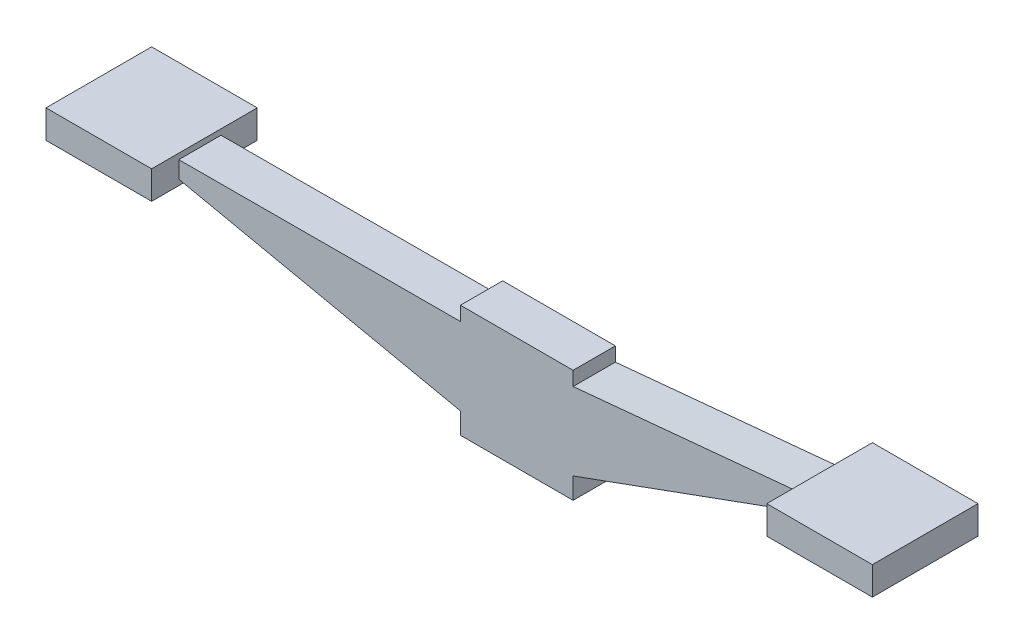
ISO-10303-21;
HEADER;
FILE_DESCRIPTION(('STEP AP214'),'2;1');
FILE_NAME('part.step','',(''),(''),'','','');
FILE_SCHEMA(('AUTOMOTIVE_DESIGN { 1 0 10303 214 1 1 1 1 }'));
ENDSEC;
DATA;
#1=APPLICATION_CONTEXT('core data for automotive mechanical design processes');
#2=APPLICATION_PROTOCOL_DEFINITION('international standard','automotive_design',2000,#1);
#3=PRODUCT_CONTEXT('',#1,'mechanical');
#4=PRODUCT('Part','Part','',(#3));
#5=PRODUCT_RELATED_PRODUCT_CATEGORY('part','',(#4));
#6=PRODUCT_DEFINITION_FORMATION('','',#4);
#7=PRODUCT_DEFINITION_CONTEXT('part definition',#1,'design');
#8=PRODUCT_DEFINITION('design','',#6,#7);
#9=PRODUCT_DEFINITION_SHAPE('','',#8);
#10=(LENGTH_UNIT() NAMED_UNIT(*) SI_UNIT(.MILLI.,.METRE.));
#11=(NAMED_UNIT(*) PLANE_ANGLE_UNIT() SI_UNIT($,.RADIAN.));
#12=(NAMED_UNIT(*) SI_UNIT($,.STERADIAN.) SOLID_ANGLE_UNIT());
#13=UNCERTAINTY_MEASURE_WITH_UNIT(LENGTH_MEASURE(1.E-05),#10,'distance_accuracy_value','');
#14=(GEOMETRIC_REPRESENTATION_CONTEXT(3) GLOBAL_UNCERTAINTY_ASSIGNED_CONTEXT((#13)) GLOBAL_UNIT_ASSIGNED_CONTEXT((#10,
#11,#12)) REPRESENTATION_CONTEXT('',''));
#15=CARTESIAN_POINT('',(0.,0.,0.));
#16=DIRECTION('',(0.,0.,1.));
#17=DIRECTION('',(1.,0.,0.));
#18=AXIS2_PLACEMENT_3D('',#15,#16,#17);
#19=CARTESIAN_POINT('',(0.,40.,15.));
#20=DIRECTION('',(0.,1.,0.));
#21=DIRECTION('',(0.,0.,1.));
#22=AXIS2_PLACEMENT_3D('',#19,#20,#21);
#23=PLANE('',#22);
#24=DIRECTION('',(1.,0.,0.));
#25=VECTOR('',#24,1.);
#26=CARTESIAN_POINT('',(0.,40.,-15.));
#27=LINE('',#26,#25);
#28=CARTESIAN_POINT('',(-40.,40.,-15.));
#29=VERTEX_POINT('',#28);
#30=CARTESIAN_POINT('',(40.,40.,-15.));
#31=VERTEX_POINT('',#30);
#32=EDGE_CURVE('E273',#29,#31,#27,.T.);
#33=ORIENTED_EDGE('',*,*,#32,.F.);
#34=DIRECTION('',(0.,0.,-1.));
#35=VECTOR('',#34,1.);
#36=CARTESIAN_POINT('',(-40.,40.,15.));
#37=LINE('',#36,#35);
#38=CARTESIAN_POINT('',(-40.,40.,15.));
#39=VERTEX_POINT('',#38);
#40=EDGE_CURVE('E188',#39,#29,#37,.T.);
#41=ORIENTED_EDGE('',*,*,#40,.F.);
#42=DIRECTION('',(1.,0.,0.));
#43=VECTOR('',#42,1.);
#44=CARTESIAN_POINT('',(0.,40.,15.));
#45=LINE('',#44,#43);
#46=CARTESIAN_POINT('',(40.,40.,15.));
#47=VERTEX_POINT('',#46);
#48=EDGE_CURVE('E231',#39,#47,#45,.T.);
#49=ORIENTED_EDGE('',*,*,#48,.T.);
#50=DIRECTION('',(0.,0.,-1.));
#51=VECTOR('',#50,1.);
#52=CARTESIAN_POINT('',(40.,40.,15.));
#53=LINE('',#52,#51);
#54=EDGE_CURVE('E238',#47,#31,#53,.T.);
#55=ORIENTED_EDGE('',*,*,#54,.T.);
#56=EDGE_LOOP('',(#33,#41,#49,#55));
#57=FACE_BOUND('',#56,.T.);
#58=ADVANCED_FACE('F136',(#57),#23,.T.);
#59=CARTESIAN_POINT('',(0.,-40.,15.));
#60=DIRECTION('',(0.,1.,0.));
#61=DIRECTION('',(0.,0.,1.));
#62=AXIS2_PLACEMENT_3D('',#59,#60,#61);
#63=PLANE('',#62);
#64=DIRECTION('',(1.,0.,0.));
#65=VECTOR('',#64,1.);
#66=CARTESIAN_POINT('',(0.,-40.,-15.));
#67=LINE('',#66,#65);
#68=CARTESIAN_POINT('',(-40.,-40.,-15.));
#69=VERTEX_POINT('',#68);
#70=CARTESIAN_POINT('',(40.,-40.,-15.));
#71=VERTEX_POINT('',#70);
#72=EDGE_CURVE('E262',#69,#71,#67,.T.);
#73=ORIENTED_EDGE('',*,*,#72,.T.);
#74=DIRECTION('',(0.,0.,-1.));
#75=VECTOR('',#74,1.);
#76=CARTESIAN_POINT('',(40.,-40.,15.));
#77=LINE('',#76,#75);
#78=CARTESIAN_POINT('',(40.,-40.,15.));
#79=VERTEX_POINT('',#78);
#80=EDGE_CURVE('E286',#79,#71,#77,.T.);
#81=ORIENTED_EDGE('',*,*,#80,.F.);
#82=DIRECTION('',(1.,0.,0.));
#83=VECTOR('',#82,1.);
#84=CARTESIAN_POINT('',(0.,-40.,15.));
#85=LINE('',#84,#83);
#86=CARTESIAN_POINT('',(-40.,-40.,15.));
#87=VERTEX_POINT('',#86);
#88=EDGE_CURVE('E326',#87,#79,#85,.T.);
#89=ORIENTED_EDGE('',*,*,#88,.F.);
#90=DIRECTION('',(0.,0.,-1.));
#91=VECTOR('',#90,1.);
#92=CARTESIAN_POINT('',(-40.,-40.,15.));
#93=LINE('',#92,#91);
#94=EDGE_CURVE('E289',#87,#69,#93,.T.);
#95=ORIENTED_EDGE('',*,*,#94,.T.);
#96=EDGE_LOOP('',(#73,#81,#89,#95));
#97=FACE_BOUND('',#96,.T.);
#98=ADVANCED_FACE('F349',(#97),#63,.F.);
#99=CARTESIAN_POINT('',(-40.,0.,15.));
#100=DIRECTION('',(-1.,0.,0.));
#101=DIRECTION('',(0.,0.,1.));
#102=AXIS2_PLACEMENT_3D('',#99,#100,#101);
#103=PLANE('',#102);
#104=DIRECTION('',(0.,1.,0.));
#105=VECTOR('',#104,1.);
#106=CARTESIAN_POINT('',(-40.,0.,-15.));
#107=LINE('',#106,#105);
#108=CARTESIAN_POINT('',(-40.,-25.,-15.));
#109=VERTEX_POINT('',#108);
#110=EDGE_CURVE('E259',#69,#109,#107,.T.);
#111=ORIENTED_EDGE('',*,*,#110,.F.);
#112=ORIENTED_EDGE('',*,*,#94,.F.);
#113=DIRECTION('',(0.,1.,0.));
#114=VECTOR('',#113,1.);
#115=CARTESIAN_POINT('',(-40.,0.,15.));
#116=LINE('',#115,#114);
#117=CARTESIAN_POINT('',(-40.,-25.,15.));
#118=VERTEX_POINT('',#117);
#119=EDGE_CURVE('E249',#87,#118,#116,.T.);
#120=ORIENTED_EDGE('',*,*,#119,.T.);
#121=DIRECTION('',(0.,0.,-1.));
#122=VECTOR('',#121,1.);
#123=CARTESIAN_POINT('',(-40.,-25.,15.));
#124=LINE('',#123,#122);
#125=EDGE_CURVE('E200',#118,#109,#124,.T.);
#126=ORIENTED_EDGE('',*,*,#125,.T.);
#127=EDGE_LOOP('',(#111,#112,#120,#126));
#128=FACE_BOUND('',#127,.T.);
#129=ADVANCED_FACE('F341',(#128),#103,.T.);
#130=CARTESIAN_POINT('',(-40.,30.,-15.));
#131=VERTEX_POINT('',#130);
#132=EDGE_CURVE('E263',#131,#29,#107,.T.);
#133=ORIENTED_EDGE('',*,*,#132,.F.);
#134=DIRECTION('',(0.,0.,-1.));
#135=VECTOR('',#134,1.);
#136=CARTESIAN_POINT('',(-40.,30.,15.));
#137=LINE('',#136,#135);
#138=CARTESIAN_POINT('',(-40.,30.,15.));
#139=VERTEX_POINT('',#138);
#140=EDGE_CURVE('E155',#139,#131,#137,.T.);
#141=ORIENTED_EDGE('',*,*,#140,.F.);
#142=EDGE_CURVE('E246',#139,#39,#116,.T.);
#143=ORIENTED_EDGE('',*,*,#142,.T.);
#144=ORIENTED_EDGE('',*,*,#40,.T.);
#145=EDGE_LOOP('',(#133,#141,#143,#144));
#146=FACE_BOUND('',#145,.T.);
#147=ADVANCED_FACE('F339',(#146),#103,.T.);
#148=CARTESIAN_POINT('',(40.,0.,15.));
#149=DIRECTION('',(-1.,0.,0.));
#150=DIRECTION('',(0.,0.,1.));
#151=AXIS2_PLACEMENT_3D('',#148,#149,#150);
#152=PLANE('',#151);
#153=DIRECTION('',(0.,1.,0.));
#154=VECTOR('',#153,1.);
#155=CARTESIAN_POINT('',(40.,0.,-15.));
#156=LINE('',#155,#154);
#157=CARTESIAN_POINT('',(40.,30.,-15.));
#158=VERTEX_POINT('',#157);
#159=EDGE_CURVE('E241',#158,#31,#156,.T.);
#160=ORIENTED_EDGE('',*,*,#159,.T.);
#161=ORIENTED_EDGE('',*,*,#54,.F.);
#162=DIRECTION('',(0.,1.,0.));
#163=VECTOR('',#162,1.);
#164=CARTESIAN_POINT('',(40.,0.,15.));
#165=LINE('',#164,#163);
#166=CARTESIAN_POINT('',(40.,30.,15.));
#167=VERTEX_POINT('',#166);
#168=EDGE_CURVE('E226',#167,#47,#165,.T.);
#169=ORIENTED_EDGE('',*,*,#168,.F.);
#170=DIRECTION('',(0.,0.,-1.));
#171=VECTOR('',#170,1.);
#172=CARTESIAN_POINT('',(40.,30.,15.));
#173=LINE('',#172,#171);
#174=EDGE_CURVE('E244',#167,#158,#173,.T.);
#175=ORIENTED_EDGE('',*,*,#174,.T.);
#176=EDGE_LOOP('',(#160,#161,#169,#175));
#177=FACE_BOUND('',#176,.T.);
#178=ADVANCED_FACE('F239',(#177),#152,.F.);
#179=CARTESIAN_POINT('',(40.,-25.,-15.));
#180=VERTEX_POINT('',#179);
#181=EDGE_CURVE('E265',#71,#180,#156,.T.);
#182=ORIENTED_EDGE('',*,*,#181,.T.);
#183=DIRECTION('',(0.,0.,-1.));
#184=VECTOR('',#183,1.);
#185=CARTESIAN_POINT('',(40.,-25.,15.));
#186=LINE('',#185,#184);
#187=CARTESIAN_POINT('',(40.,-25.,15.));
#188=VERTEX_POINT('',#187);
#189=EDGE_CURVE('E283',#188,#180,#186,.T.);
#190=ORIENTED_EDGE('',*,*,#189,.F.);
#191=EDGE_CURVE('E236',#79,#188,#165,.T.);
#192=ORIENTED_EDGE('',*,*,#191,.F.);
#193=ORIENTED_EDGE('',*,*,#80,.T.);
#194=EDGE_LOOP('',(#182,#190,#192,#193));
#195=FACE_BOUND('',#194,.T.);
#196=ADVANCED_FACE('F347',(#195),#152,.F.);
#197=CARTESIAN_POINT('',(0.,0.,15.));
#198=DIRECTION('',(0.,0.,1.));
#199=DIRECTION('',(1.,0.,0.));
#200=AXIS2_PLACEMENT_3D('',#197,#198,#199);
#201=PLANE('',#200);
#202=DIRECTION('',(0.,-1.,0.));
#203=VECTOR('',#202,1.);
#204=CARTESIAN_POINT('',(200.,1.46081976924363E-13,15.));
#205=LINE('',#204,#203);
#206=CARTESIAN_POINT('',(200.,45.2352374825919,15.));
#207=VERTEX_POINT('',#206);
#208=CARTESIAN_POINT('',(200.,33.2352374825919,15.));
#209=VERTEX_POINT('',#208);
#210=EDGE_CURVE('E425',#207,#209,#205,.T.);
#211=ORIENTED_EDGE('',*,*,#210,.F.);
#212=DIRECTION('',(0.995497150601956,0.0947914718916521,0.));
#213=VECTOR('',#212,1.);
#214=CARTESIAN_POINT('',(-2.47152227934972,25.9558516989182,15.));
#215=LINE('',#214,#213);
#216=EDGE_CURVE('E233',#167,#207,#215,.T.);
#217=ORIENTED_EDGE('',*,*,#216,.F.);
#218=ORIENTED_EDGE('',*,*,#168,.T.);
#219=ORIENTED_EDGE('',*,*,#48,.F.);
#220=ORIENTED_EDGE('',*,*,#142,.F.);
#221=DIRECTION('',(-0.999997014817931,-0.00244343103587318,0.));
#222=VECTOR('',#221,1.);
#223=CARTESIAN_POINT('',(-0.0735415264626827,30.0975578390147,15.));
#224=LINE('',#223,#222);
#225=CARTESIAN_POINT('',(-240.,29.5113123340037,15.));
#226=VERTEX_POINT('',#225);
#227=EDGE_CURVE('E320',#139,#226,#224,.T.);
#228=ORIENTED_EDGE('',*,*,#227,.T.);
#229=DIRECTION('',(0.,1.,0.));
#230=VECTOR('',#229,1.);
#231=CARTESIAN_POINT('',(-240.,0.,15.));
#232=LINE('',#231,#230);
#233=CARTESIAN_POINT('',(-240.,17.5113123340037,15.));
#234=VERTEX_POINT('',#233);
#235=EDGE_CURVE('E300',#234,#226,#232,.T.);
#236=ORIENTED_EDGE('',*,*,#235,.F.);
#237=DIRECTION('',(-0.978147600733806,0.207911690817756,0.));
#238=VECTOR('',#237,1.);
#239=CARTESIAN_POINT('',(-6.81329888559535,-32.0540510820484,15.));
#240=LINE('',#239,#238);
#241=EDGE_CURVE('E323',#118,#234,#240,.T.);
#242=ORIENTED_EDGE('',*,*,#241,.F.);
#243=ORIENTED_EDGE('',*,*,#119,.F.);
#244=ORIENTED_EDGE('',*,*,#88,.T.);
#245=ORIENTED_EDGE('',*,*,#191,.T.);
#246=DIRECTION('',(0.939692620785909,0.342020143325666,0.));
#247=VECTOR('',#246,1.);
#248=CARTESIAN_POINT('',(12.7139562587021,-34.931307732718,15.));
#249=LINE('',#248,#247);
#250=EDGE_CURVE('E327',#188,#209,#249,.T.);
#251=ORIENTED_EDGE('',*,*,#250,.T.);
#252=EDGE_LOOP('',(#211,#217,#218,#219,#220,#228,#236,#242,#243,#244,#245,#251));
#253=FACE_BOUND('',#252,.T.);
#254=ADVANCED_FACE('F228',(#253),#201,.T.);
#255=CARTESIAN_POINT('',(0.,0.,-15.));
#256=DIRECTION('',(0.,0.,1.));
#257=DIRECTION('',(1.,0.,0.));
#258=AXIS2_PLACEMENT_3D('',#255,#256,#257);
#259=PLANE('',#258);
#260=DIRECTION('',(0.995497150601956,0.0947914718916521,0.));
#261=VECTOR('',#260,1.);
#262=CARTESIAN_POINT('',(-2.47152227934972,25.9558516989182,-15.));
#263=LINE('',#262,#261);
#264=CARTESIAN_POINT('',(200.,45.2352374825919,-15.));
#265=VERTEX_POINT('',#264);
#266=EDGE_CURVE('E270',#158,#265,#263,.T.);
#267=ORIENTED_EDGE('',*,*,#266,.T.);
#268=DIRECTION('',(0.,-1.,0.));
#269=VECTOR('',#268,1.);
#270=CARTESIAN_POINT('',(200.,1.46081976924363E-13,-15.));
#271=LINE('',#270,#269);
#272=CARTESIAN_POINT('',(200.,33.2352374825919,-15.));
#273=VERTEX_POINT('',#272);
#274=EDGE_CURVE('E424',#265,#273,#271,.T.);
#275=ORIENTED_EDGE('',*,*,#274,.T.);
#276=DIRECTION('',(0.939692620785909,0.342020143325666,0.));
#277=VECTOR('',#276,1.);
#278=CARTESIAN_POINT('',(12.7139562587021,-34.931307732718,-15.));
#279=LINE('',#278,#277);
#280=EDGE_CURVE('E267',#180,#273,#279,.T.);
#281=ORIENTED_EDGE('',*,*,#280,.F.);
#282=ORIENTED_EDGE('',*,*,#181,.F.);
#283=ORIENTED_EDGE('',*,*,#72,.F.);
#284=ORIENTED_EDGE('',*,*,#110,.T.);
#285=DIRECTION('',(-0.978147600733806,0.207911690817756,0.));
#286=VECTOR('',#285,1.);
#287=CARTESIAN_POINT('',(-6.81329888559535,-32.0540510820484,-15.));
#288=LINE('',#287,#286);
#289=CARTESIAN_POINT('',(-240.,17.5113123340037,-15.));
#290=VERTEX_POINT('',#289);
#291=EDGE_CURVE('E255',#109,#290,#288,.T.);
#292=ORIENTED_EDGE('',*,*,#291,.T.);
#293=DIRECTION('',(0.,1.,0.));
#294=VECTOR('',#293,1.);
#295=CARTESIAN_POINT('',(-240.,0.,-15.));
#296=LINE('',#295,#294);
#297=CARTESIAN_POINT('',(-240.,29.5113123340037,-15.));
#298=VERTEX_POINT('',#297);
#299=EDGE_CURVE('E309',#290,#298,#296,.T.);
#300=ORIENTED_EDGE('',*,*,#299,.T.);
#301=DIRECTION('',(-0.999997014817931,-0.00244343103587318,0.));
#302=VECTOR('',#301,1.);
#303=CARTESIAN_POINT('',(-0.0735415264626827,30.0975578390147,-15.));
#304=LINE('',#303,#302);
#305=EDGE_CURVE('E253',#131,#298,#304,.T.);
#306=ORIENTED_EDGE('',*,*,#305,.F.);
#307=ORIENTED_EDGE('',*,*,#132,.T.);
#308=ORIENTED_EDGE('',*,*,#32,.T.);
#309=ORIENTED_EDGE('',*,*,#159,.F.);
#310=EDGE_LOOP('',(#267,#275,#281,#282,#283,#284,#292,#300,#306,#307,#308,#309));
#311=FACE_BOUND('',#310,.T.);
#312=ADVANCED_FACE('F336',(#311),#259,.F.);
#313=CARTESIAN_POINT('',(12.7139562587021,-34.931307732718,15.));
#314=DIRECTION('',(-0.342020143325666,0.939692620785909,0.));
#315=DIRECTION('',(-0.93969262078591,-0.342020143325666,0.));
#316=AXIS2_PLACEMENT_3D('',#313,#314,#315);
#317=PLANE('',#316);
#318=ORIENTED_EDGE('',*,*,#280,.T.);
#319=DIRECTION('',(0.,0.,-1.));
#320=VECTOR('',#319,1.);
#321=CARTESIAN_POINT('',(200.,33.2352374825919,15.));
#322=LINE('',#321,#320);
#323=EDGE_CURVE('E280',#209,#273,#322,.T.);
#324=ORIENTED_EDGE('',*,*,#323,.F.);
#325=ORIENTED_EDGE('',*,*,#250,.F.);
#326=ORIENTED_EDGE('',*,*,#189,.T.);
#327=EDGE_LOOP('',(#318,#324,#325,#326));
#328=FACE_BOUND('',#327,.T.);
#329=ADVANCED_FACE('F387',(#328),#317,.F.);
#330=CARTESIAN_POINT('',(-2.47152227934972,25.9558516989182,15.));
#331=DIRECTION('',(-0.094791471891652,0.995497150601956,0.));
#332=DIRECTION('',(-0.995497150601956,-0.094791471891652,0.));
#333=AXIS2_PLACEMENT_3D('',#330,#331,#332);
#334=PLANE('',#333);
#335=ORIENTED_EDGE('',*,*,#266,.F.);
#336=ORIENTED_EDGE('',*,*,#174,.F.);
#337=ORIENTED_EDGE('',*,*,#216,.T.);
#338=DIRECTION('',(0.,0.,-1.));
#339=VECTOR('',#338,1.);
#340=CARTESIAN_POINT('',(200.,45.2352374825919,15.));
#341=LINE('',#340,#339);
#342=EDGE_CURVE('E278',#207,#265,#341,.T.);
#343=ORIENTED_EDGE('',*,*,#342,.T.);
#344=EDGE_LOOP('',(#335,#336,#337,#343));
#345=FACE_BOUND('',#344,.T.);
#346=ADVANCED_FACE('F333',(#345),#334,.T.);
#347=CARTESIAN_POINT('',(-0.0735415264626827,30.0975578390147,15.));
#348=DIRECTION('',(0.00244343103587318,-0.999997014817931,0.));
#349=DIRECTION('',(0.999997014817931,0.00244343103587318,0.));
#350=AXIS2_PLACEMENT_3D('',#347,#348,#349);
#351=PLANE('',#350);
#352=ORIENTED_EDGE('',*,*,#305,.T.);
#353=DIRECTION('',(0.,0.,-1.));
#354=VECTOR('',#353,1.);
#355=CARTESIAN_POINT('',(-240.,29.5113123340037,15.));
#356=LINE('',#355,#354);
#357=EDGE_CURVE('E12',#226,#298,#356,.T.);
#358=ORIENTED_EDGE('',*,*,#357,.F.);
#359=ORIENTED_EDGE('',*,*,#227,.F.);
#360=ORIENTED_EDGE('',*,*,#140,.T.);
#361=EDGE_LOOP('',(#352,#358,#359,#360));
#362=FACE_BOUND('',#361,.T.);
#363=ADVANCED_FACE('F375',(#362),#351,.F.);
#364=CARTESIAN_POINT('',(-6.81329888559535,-32.0540510820484,15.));
#365=DIRECTION('',(-0.207911690817756,-0.978147600733806,0.));
#366=DIRECTION('',(0.978147600733806,-0.207911690817756,0.));
#367=AXIS2_PLACEMENT_3D('',#364,#365,#366);
#368=PLANE('',#367);
#369=ORIENTED_EDGE('',*,*,#291,.F.);
#370=ORIENTED_EDGE('',*,*,#125,.F.);
#371=ORIENTED_EDGE('',*,*,#241,.T.);
#372=DIRECTION('',(0.,0.,-1.));
#373=VECTOR('',#372,1.);
#374=CARTESIAN_POINT('',(-240.,17.5113123340037,15.));
#375=LINE('',#374,#373);
#376=EDGE_CURVE('E146',#234,#290,#375,.T.);
#377=ORIENTED_EDGE('',*,*,#376,.T.);
#378=EDGE_LOOP('',(#369,#370,#371,#377));
#379=FACE_BOUND('',#378,.T.);
#380=ADVANCED_FACE('F370',(#379),#368,.T.);
#381=CARTESIAN_POINT('',(200.,49.2352374825918,15.));
#382=DIRECTION('',(0.,1.,0.));
#383=DIRECTION('',(-1.,0.,0.));
#384=AXIS2_PLACEMENT_3D('',#381,#382,#383);
#385=PLANE('',#384);
#386=DIRECTION('',(-1.,0.,0.));
#387=VECTOR('',#386,1.);
#388=CARTESIAN_POINT('',(200.,49.2352374825918,-37.5));
#389=LINE('',#388,#387);
#390=CARTESIAN_POINT('',(275.,49.2352374825919,-37.5));
#391=VERTEX_POINT('',#390);
#392=CARTESIAN_POINT('',(200.,49.2352374825918,-37.5));
#393=VERTEX_POINT('',#392);
#394=EDGE_CURVE('E692',#391,#393,#389,.T.);
#395=ORIENTED_EDGE('',*,*,#394,.T.);
#396=DIRECTION('',(0.,0.,-1.));
#397=VECTOR('',#396,1.);
#398=CARTESIAN_POINT('',(200.,49.2352374825918,15.));
#399=LINE('',#398,#397);
#400=CARTESIAN_POINT('',(200.,49.2352374825918,37.5));
#401=VERTEX_POINT('',#400);
#402=EDGE_CURVE('E140',#401,#393,#399,.T.);
#403=ORIENTED_EDGE('',*,*,#402,.F.);
#404=DIRECTION('',(1.,0.,0.));
#405=VECTOR('',#404,1.);
#406=CARTESIAN_POINT('',(200.,49.2352374825918,37.5));
#407=LINE('',#406,#405);
#408=CARTESIAN_POINT('',(275.,49.2352374825919,37.5));
#409=VERTEX_POINT('',#408);
#410=EDGE_CURVE('E704',#401,#409,#407,.T.);
#411=ORIENTED_EDGE('',*,*,#410,.T.);
#412=DIRECTION('',(0.,0.,-1.));
#413=VECTOR('',#412,1.);
#414=CARTESIAN_POINT('',(275.,49.2352374825919,-37.5));
#415=LINE('',#414,#413);
#416=EDGE_CURVE('E701',#409,#391,#415,.T.);
#417=ORIENTED_EDGE('',*,*,#416,.T.);
#418=EDGE_LOOP('',(#395,#403,#411,#417));
#419=FACE_BOUND('',#418,.T.);
#420=ADVANCED_FACE('F366',(#419),#385,.T.);
#421=CARTESIAN_POINT('',(200.,29.2352374825919,15.));
#422=DIRECTION('',(0.,1.,0.));
#423=DIRECTION('',(0.,0.,1.));
#424=AXIS2_PLACEMENT_3D('',#421,#422,#423);
#425=PLANE('',#424);
#426=DIRECTION('',(0.,0.,-1.));
#427=VECTOR('',#426,1.);
#428=CARTESIAN_POINT('',(200.,29.2352374825919,15.));
#429=LINE('',#428,#427);
#430=CARTESIAN_POINT('',(200.,29.2352374825919,37.5));
#431=VERTEX_POINT('',#430);
#432=CARTESIAN_POINT('',(200.,29.2352374825919,-37.5));
#433=VERTEX_POINT('',#432);
#434=EDGE_CURVE('E298',#431,#433,#429,.T.);
#435=ORIENTED_EDGE('',*,*,#434,.T.);
#436=DIRECTION('',(1.,0.,0.));
#437=VECTOR('',#436,1.);
#438=CARTESIAN_POINT('',(200.,29.2352374825919,-37.5));
#439=LINE('',#438,#437);
#440=CARTESIAN_POINT('',(275.,29.2352374825919,-37.5));
#441=VERTEX_POINT('',#440);
#442=EDGE_CURVE('E687',#433,#441,#439,.T.);
#443=ORIENTED_EDGE('',*,*,#442,.T.);
#444=DIRECTION('',(0.,0.,1.));
#445=VECTOR('',#444,1.);
#446=CARTESIAN_POINT('',(275.,29.2352374825919,-37.5));
#447=LINE('',#446,#445);
#448=CARTESIAN_POINT('',(275.,29.2352374825919,37.5));
#449=VERTEX_POINT('',#448);
#450=EDGE_CURVE('E688',#441,#449,#447,.T.);
#451=ORIENTED_EDGE('',*,*,#450,.T.);
#452=DIRECTION('',(-1.,0.,0.));
#453=VECTOR('',#452,1.);
#454=CARTESIAN_POINT('',(200.,29.2352374825919,37.5));
#455=LINE('',#454,#453);
#456=EDGE_CURVE('E431',#449,#431,#455,.T.);
#457=ORIENTED_EDGE('',*,*,#456,.T.);
#458=EDGE_LOOP('',(#435,#443,#451,#457));
#459=FACE_BOUND('',#458,.T.);
#460=ADVANCED_FACE('F138',(#459),#425,.F.);
#461=CARTESIAN_POINT('',(200.,49.2352374825918,15.));
#462=DIRECTION('',(1.,0.,0.));
#463=DIRECTION('',(0.,0.,-1.));
#464=AXIS2_PLACEMENT_3D('',#461,#462,#463);
#465=PLANE('',#464);
#466=ORIENTED_EDGE('',*,*,#342,.F.);
#467=ORIENTED_EDGE('',*,*,#210,.T.);
#468=ORIENTED_EDGE('',*,*,#323,.T.);
#469=ORIENTED_EDGE('',*,*,#274,.F.);
#470=EDGE_LOOP('',(#466,#467,#468,#469));
#471=FACE_BOUND('',#470,.T.);
#472=ORIENTED_EDGE('',*,*,#434,.F.);
#473=DIRECTION('',(0.,1.,0.));
#474=VECTOR('',#473,1.);
#475=CARTESIAN_POINT('',(200.,-76.8307796953902,37.5));
#476=LINE('',#475,#474);
#477=EDGE_CURVE('E683',#431,#401,#476,.T.);
#478=ORIENTED_EDGE('',*,*,#477,.T.);
#479=ORIENTED_EDGE('',*,*,#402,.T.);
#480=DIRECTION('',(0.,1.,0.));
#481=VECTOR('',#480,1.);
#482=CARTESIAN_POINT('',(200.,-76.8307796953902,-37.5));
#483=LINE('',#482,#481);
#484=EDGE_CURVE('E697',#433,#393,#483,.T.);
#485=ORIENTED_EDGE('',*,*,#484,.F.);
#486=EDGE_LOOP('',(#472,#478,#479,#485));
#487=FACE_BOUND('',#486,.T.);
#488=ADVANCED_FACE('F353',(#471,#487),#465,.F.);
#489=CARTESIAN_POINT('',(-297.,13.5113123340037,15.));
#490=DIRECTION('',(0.,1.,0.));
#491=DIRECTION('',(-1.,0.,0.));
#492=AXIS2_PLACEMENT_3D('',#489,#490,#491);
#493=PLANE('',#492);
#494=DIRECTION('',(0.,0.,-1.));
#495=VECTOR('',#494,1.);
#496=CARTESIAN_POINT('',(-240.,13.5113123340037,15.));
#497=LINE('',#496,#495);
#498=CARTESIAN_POINT('',(-240.,13.5113123340037,34.275174048456));
#499=VERTEX_POINT('',#498);
#500=CARTESIAN_POINT('',(-240.,13.5113123340037,-40.724825951544));
#501=VERTEX_POINT('',#500);
#502=EDGE_CURVE('E256',#499,#501,#497,.T.);
#503=ORIENTED_EDGE('',*,*,#502,.F.);
#504=DIRECTION('',(-1.,0.,0.));
#505=VECTOR('',#504,1.);
#506=CARTESIAN_POINT('',(-240.,13.5113123340037,34.275174048456));
#507=LINE('',#506,#505);
#508=CARTESIAN_POINT('',(-315.,13.5113123340037,34.275174048456));
#509=VERTEX_POINT('',#508);
#510=EDGE_CURVE('E438',#499,#509,#507,.T.);
#511=ORIENTED_EDGE('',*,*,#510,.T.);
#512=DIRECTION('',(0.,0.,-1.));
#513=VECTOR('',#512,1.);
#514=CARTESIAN_POINT('',(-315.,13.5113123340037,-40.724825951544));
#515=LINE('',#514,#513);
#516=CARTESIAN_POINT('',(-315.,13.5113123340037,-40.724825951544));
#517=VERTEX_POINT('',#516);
#518=EDGE_CURVE('E435',#509,#517,#515,.T.);
#519=ORIENTED_EDGE('',*,*,#518,.T.);
#520=DIRECTION('',(1.,0.,0.));
#521=VECTOR('',#520,1.);
#522=CARTESIAN_POINT('',(-240.,13.5113123340037,-40.724825951544));
#523=LINE('',#522,#521);
#524=EDGE_CURVE('E316',#517,#501,#523,.T.);
#525=ORIENTED_EDGE('',*,*,#524,.T.);
#526=EDGE_LOOP('',(#503,#511,#519,#525));
#527=FACE_BOUND('',#526,.T.);
#528=ADVANCED_FACE('F355',(#527),#493,.F.);
#529=CARTESIAN_POINT('',(-297.,33.5113123340037,15.));
#530=DIRECTION('',(0.,1.,0.));
#531=DIRECTION('',(0.,0.,1.));
#532=AXIS2_PLACEMENT_3D('',#529,#530,#531);
#533=PLANE('',#532);
#534=DIRECTION('',(1.,0.,0.));
#535=VECTOR('',#534,1.);
#536=CARTESIAN_POINT('',(-240.,33.5113123340037,34.275174048456));
#537=LINE('',#536,#535);
#538=CARTESIAN_POINT('',(-315.,33.5113123340037,34.275174048456));
#539=VERTEX_POINT('',#538);
#540=CARTESIAN_POINT('',(-240.,33.5113123340037,34.275174048456));
#541=VERTEX_POINT('',#540);
#542=EDGE_CURVE('E443',#539,#541,#537,.T.);
#543=ORIENTED_EDGE('',*,*,#542,.T.);
#544=DIRECTION('',(0.,0.,-1.));
#545=VECTOR('',#544,1.);
#546=CARTESIAN_POINT('',(-240.,33.5113123340037,15.));
#547=LINE('',#546,#545);
#548=CARTESIAN_POINT('',(-240.,33.5113123340037,-40.724825951544));
#549=VERTEX_POINT('',#548);
#550=EDGE_CURVE('E294',#541,#549,#547,.T.);
#551=ORIENTED_EDGE('',*,*,#550,.T.);
#552=DIRECTION('',(-1.,0.,0.));
#553=VECTOR('',#552,1.);
#554=CARTESIAN_POINT('',(-240.,33.5113123340037,-40.724825951544));
#555=LINE('',#554,#553);
#556=CARTESIAN_POINT('',(-315.,33.5113123340037,-40.724825951544));
#557=VERTEX_POINT('',#556);
#558=EDGE_CURVE('E426',#549,#557,#555,.T.);
#559=ORIENTED_EDGE('',*,*,#558,.T.);
#560=DIRECTION('',(0.,0.,1.));
#561=VECTOR('',#560,1.);
#562=CARTESIAN_POINT('',(-315.,33.5113123340037,-40.724825951544));
#563=LINE('',#562,#561);
#564=EDGE_CURVE('E429',#557,#539,#563,.T.);
#565=ORIENTED_EDGE('',*,*,#564,.T.);
#566=EDGE_LOOP('',(#543,#551,#559,#565));
#567=FACE_BOUND('',#566,.T.);
#568=ADVANCED_FACE('F362',(#567),#533,.T.);
#569=CARTESIAN_POINT('',(-240.,33.5113123340037,15.));
#570=DIRECTION('',(1.,0.,0.));
#571=DIRECTION('',(0.,1.,0.));
#572=AXIS2_PLACEMENT_3D('',#569,#570,#571);
#573=PLANE('',#572);
#574=DIRECTION('',(0.,1.,0.));
#575=VECTOR('',#574,1.);
#576=CARTESIAN_POINT('',(-240.,-92.5547048439784,34.275174048456));
#577=LINE('',#576,#575);
#578=EDGE_CURVE('E408',#499,#541,#577,.T.);
#579=ORIENTED_EDGE('',*,*,#578,.F.);
#580=ORIENTED_EDGE('',*,*,#502,.T.);
#581=DIRECTION('',(0.,1.,0.));
#582=VECTOR('',#581,1.);
#583=CARTESIAN_POINT('',(-240.,-92.5547048439784,-40.724825951544));
#584=LINE('',#583,#582);
#585=EDGE_CURVE('E446',#501,#549,#584,.T.);
#586=ORIENTED_EDGE('',*,*,#585,.T.);
#587=ORIENTED_EDGE('',*,*,#550,.F.);
#588=EDGE_LOOP('',(#579,#580,#586,#587));
#589=FACE_BOUND('',#588,.T.);
#590=ORIENTED_EDGE('',*,*,#376,.F.);
#591=ORIENTED_EDGE('',*,*,#235,.T.);
#592=ORIENTED_EDGE('',*,*,#357,.T.);
#593=ORIENTED_EDGE('',*,*,#299,.F.);
#594=EDGE_LOOP('',(#590,#591,#592,#593));
#595=FACE_BOUND('',#594,.T.);
#596=ADVANCED_FACE('F365',(#589,#595),#573,.T.);
#597=CARTESIAN_POINT('',(-240.,-92.5547048439784,34.275174048456));
#598=DIRECTION('',(0.,0.,1.));
#599=DIRECTION('',(1.,0.,0.));
#600=AXIS2_PLACEMENT_3D('',#597,#598,#599);
#601=PLANE('',#600);
#602=ORIENTED_EDGE('',*,*,#510,.F.);
#603=ORIENTED_EDGE('',*,*,#578,.T.);
#604=ORIENTED_EDGE('',*,*,#542,.F.);
#605=DIRECTION('',(0.,1.,0.));
#606=VECTOR('',#605,1.);
#607=CARTESIAN_POINT('',(-315.,-92.5547048439784,34.275174048456));
#608=LINE('',#607,#606);
#609=EDGE_CURVE('E448',#509,#539,#608,.T.);
#610=ORIENTED_EDGE('',*,*,#609,.F.);
#611=EDGE_LOOP('',(#602,#603,#604,#610));
#612=FACE_BOUND('',#611,.T.);
#613=ADVANCED_FACE('F395',(#612),#601,.T.);
#614=CARTESIAN_POINT('',(-315.,-92.5547048439784,-40.724825951544));
#615=DIRECTION('',(-1.,0.,0.));
#616=DIRECTION('',(0.,0.,1.));
#617=AXIS2_PLACEMENT_3D('',#614,#615,#616);
#618=PLANE('',#617);
#619=ORIENTED_EDGE('',*,*,#518,.F.);
#620=ORIENTED_EDGE('',*,*,#609,.T.);
#621=ORIENTED_EDGE('',*,*,#564,.F.);
#622=DIRECTION('',(0.,1.,0.));
#623=VECTOR('',#622,1.);
#624=CARTESIAN_POINT('',(-315.,-92.5547048439784,-40.724825951544));
#625=LINE('',#624,#623);
#626=EDGE_CURVE('E451',#517,#557,#625,.T.);
#627=ORIENTED_EDGE('',*,*,#626,.F.);
#628=EDGE_LOOP('',(#619,#620,#621,#627));
#629=FACE_BOUND('',#628,.T.);
#630=ADVANCED_FACE('F401',(#629),#618,.T.);
#631=CARTESIAN_POINT('',(-240.,-92.5547048439784,-40.724825951544));
#632=DIRECTION('',(0.,0.,-1.));
#633=DIRECTION('',(-1.,0.,0.));
#634=AXIS2_PLACEMENT_3D('',#631,#632,#633);
#635=PLANE('',#634);
#636=ORIENTED_EDGE('',*,*,#524,.F.);
#637=ORIENTED_EDGE('',*,*,#626,.T.);
#638=ORIENTED_EDGE('',*,*,#558,.F.);
#639=ORIENTED_EDGE('',*,*,#585,.F.);
#640=EDGE_LOOP('',(#636,#637,#638,#639));
#641=FACE_BOUND('',#640,.T.);
#642=ADVANCED_FACE('F467',(#641),#635,.T.);
#643=CARTESIAN_POINT('',(200.,-76.8307796953902,-37.5));
#644=DIRECTION('',(0.,0.,-1.));
#645=DIRECTION('',(-1.,0.,0.));
#646=AXIS2_PLACEMENT_3D('',#643,#644,#645);
#647=PLANE('',#646);
#648=ORIENTED_EDGE('',*,*,#442,.F.);
#649=ORIENTED_EDGE('',*,*,#484,.T.);
#650=ORIENTED_EDGE('',*,*,#394,.F.);
#651=DIRECTION('',(0.,1.,0.));
#652=VECTOR('',#651,1.);
#653=CARTESIAN_POINT('',(275.,-76.8307796953902,-37.5));
#654=LINE('',#653,#652);
#655=EDGE_CURVE('E694',#441,#391,#654,.T.);
#656=ORIENTED_EDGE('',*,*,#655,.F.);
#657=EDGE_LOOP('',(#648,#649,#650,#656));
#658=FACE_BOUND('',#657,.T.);
#659=ADVANCED_FACE('F493',(#658),#647,.T.);
#660=CARTESIAN_POINT('',(275.,-76.8307796953902,-37.5));
#661=DIRECTION('',(1.,0.,0.));
#662=DIRECTION('',(0.,1.,0.));
#663=AXIS2_PLACEMENT_3D('',#660,#661,#662);
#664=PLANE('',#663);
#665=ORIENTED_EDGE('',*,*,#450,.F.);
#666=ORIENTED_EDGE('',*,*,#655,.T.);
#667=ORIENTED_EDGE('',*,*,#416,.F.);
#668=DIRECTION('',(0.,1.,0.));
#669=VECTOR('',#668,1.);
#670=CARTESIAN_POINT('',(275.,-76.8307796953902,37.5));
#671=LINE('',#670,#669);
#672=EDGE_CURVE('E679',#449,#409,#671,.T.);
#673=ORIENTED_EDGE('',*,*,#672,.F.);
#674=EDGE_LOOP('',(#665,#666,#667,#673));
#675=FACE_BOUND('',#674,.T.);
#676=ADVANCED_FACE('F621',(#675),#664,.T.);
#677=CARTESIAN_POINT('',(200.,-76.8307796953902,37.5));
#678=DIRECTION('',(0.,0.,1.));
#679=DIRECTION('',(1.,0.,0.));
#680=AXIS2_PLACEMENT_3D('',#677,#678,#679);
#681=PLANE('',#680);
#682=ORIENTED_EDGE('',*,*,#456,.F.);
#683=ORIENTED_EDGE('',*,*,#672,.T.);
#684=ORIENTED_EDGE('',*,*,#410,.F.);
#685=ORIENTED_EDGE('',*,*,#477,.F.);
#686=EDGE_LOOP('',(#682,#683,#684,#685));
#687=FACE_BOUND('',#686,.T.);
#688=ADVANCED_FACE('F629',(#687),#681,.T.);
#689=CLOSED_SHELL('',(#58,#98,#129,#147,#178,#196,#254,#312,#329,#346,#363,#380,#420,#460,#488,
#528,#568,#596,#613,#630,#642,#659,#676,#688));
#690=MANIFOLD_SOLID_BREP('B2',#689);
#691=ADVANCED_BREP_SHAPE_REPRESENTATION('',(#18,#690),#14);
#692=SHAPE_DEFINITION_REPRESENTATION(#9,#691);
ENDSEC;
END-ISO-10303-21;
